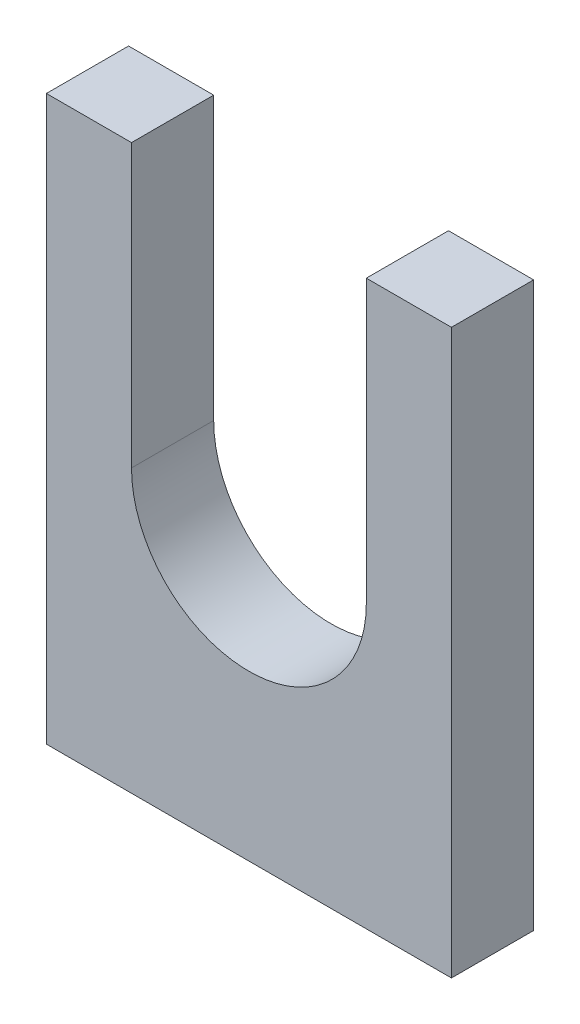
ISO-10303-21;
HEADER;
FILE_DESCRIPTION(('STEP AP214'),'2;1');
FILE_NAME('part.step','',(''),(''),'','','');
FILE_SCHEMA(('AUTOMOTIVE_DESIGN { 1 0 10303 214 1 1 1 1 }'));
ENDSEC;
DATA;
#1=APPLICATION_CONTEXT('core data for automotive mechanical design processes');
#2=APPLICATION_PROTOCOL_DEFINITION('international standard','automotive_design',2000,#1);
#3=PRODUCT_CONTEXT('',#1,'mechanical');
#4=PRODUCT('Part','Part','',(#3));
#5=PRODUCT_RELATED_PRODUCT_CATEGORY('part','',(#4));
#6=PRODUCT_DEFINITION_FORMATION('','',#4);
#7=PRODUCT_DEFINITION_CONTEXT('part definition',#1,'design');
#8=PRODUCT_DEFINITION('design','',#6,#7);
#9=PRODUCT_DEFINITION_SHAPE('','',#8);
#10=(LENGTH_UNIT() NAMED_UNIT(*) SI_UNIT(.MILLI.,.METRE.));
#11=(NAMED_UNIT(*) PLANE_ANGLE_UNIT() SI_UNIT($,.RADIAN.));
#12=(NAMED_UNIT(*) SI_UNIT($,.STERADIAN.) SOLID_ANGLE_UNIT());
#13=UNCERTAINTY_MEASURE_WITH_UNIT(LENGTH_MEASURE(1.E-05),#10,'distance_accuracy_value','');
#14=(GEOMETRIC_REPRESENTATION_CONTEXT(3) GLOBAL_UNCERTAINTY_ASSIGNED_CONTEXT((#13)) GLOBAL_UNIT_ASSIGNED_CONTEXT((#10,
#11,#12)) REPRESENTATION_CONTEXT('',''));
#15=CARTESIAN_POINT('',(0.,0.,0.));
#16=DIRECTION('',(0.,0.,1.));
#17=DIRECTION('',(1.,0.,0.));
#18=AXIS2_PLACEMENT_3D('',#15,#16,#17);
#19=CARTESIAN_POINT('',(-105.225,188.892405814831,23.1));
#20=DIRECTION('',(0.,-1.,0.));
#21=DIRECTION('',(0.,0.,-1.));
#22=AXIS2_PLACEMENT_3D('',#19,#20,#21);
#23=PLANE('',#22);
#24=DIRECTION('',(-1.,0.,0.));
#25=VECTOR('',#24,1.);
#26=CARTESIAN_POINT('',(-105.225,188.892405814831,-21.35));
#27=LINE('',#26,#25);
#28=CARTESIAN_POINT('',(-59.1875,188.892405814831,-21.35));
#29=VERTEX_POINT('',#28);
#30=CARTESIAN_POINT('',(-105.225,188.892405814831,-21.35));
#31=VERTEX_POINT('',#30);
#32=EDGE_CURVE('E131',#29,#31,#27,.T.);
#33=ORIENTED_EDGE('',*,*,#32,.T.);
#34=DIRECTION('',(0.,0.,-1.));
#35=VECTOR('',#34,1.);
#36=CARTESIAN_POINT('',(-105.225,188.892405814831,23.1));
#37=LINE('',#36,#35);
#38=CARTESIAN_POINT('',(-105.225,188.892405814831,23.1));
#39=VERTEX_POINT('',#38);
#40=EDGE_CURVE('E11',#39,#31,#37,.T.);
#41=ORIENTED_EDGE('',*,*,#40,.F.);
#42=DIRECTION('',(-1.,0.,0.));
#43=VECTOR('',#42,1.);
#44=CARTESIAN_POINT('',(-105.225,188.892405814831,23.1));
#45=LINE('',#44,#43);
#46=CARTESIAN_POINT('',(-59.1875,188.892405814831,23.1));
#47=VERTEX_POINT('',#46);
#48=EDGE_CURVE('E145',#47,#39,#45,.T.);
#49=ORIENTED_EDGE('',*,*,#48,.F.);
#50=DIRECTION('',(0.,0.,-1.));
#51=VECTOR('',#50,1.);
#52=CARTESIAN_POINT('',(-59.1875,188.892405814831,23.1));
#53=LINE('',#52,#51);
#54=EDGE_CURVE('E127',#47,#29,#53,.T.);
#55=ORIENTED_EDGE('',*,*,#54,.T.);
#56=EDGE_LOOP('',(#33,#41,#49,#55));
#57=FACE_BOUND('',#56,.T.);
#58=ADVANCED_FACE('F35',(#57),#23,.F.);
#59=CARTESIAN_POINT('',(-105.225,188.892405814831,23.1));
#60=DIRECTION('',(1.,0.,0.));
#61=DIRECTION('',(0.,1.,0.));
#62=AXIS2_PLACEMENT_3D('',#59,#60,#61);
#63=PLANE('',#62);
#64=DIRECTION('',(0.,-1.,0.));
#65=VECTOR('',#64,1.);
#66=CARTESIAN_POINT('',(-105.225,188.892405814831,-21.35));
#67=LINE('',#66,#65);
#68=CARTESIAN_POINT('',(-105.225,-115.907594185169,-21.35));
#69=VERTEX_POINT('',#68);
#70=EDGE_CURVE('E134',#31,#69,#67,.T.);
#71=ORIENTED_EDGE('',*,*,#70,.T.);
#72=DIRECTION('',(0.,0.,-1.));
#73=VECTOR('',#72,1.);
#74=CARTESIAN_POINT('',(-105.225,-115.907594185169,23.1));
#75=LINE('',#74,#73);
#76=CARTESIAN_POINT('',(-105.225,-115.907594185169,23.1));
#77=VERTEX_POINT('',#76);
#78=EDGE_CURVE('E43',#77,#69,#75,.T.);
#79=ORIENTED_EDGE('',*,*,#78,.F.);
#80=DIRECTION('',(0.,-1.,0.));
#81=VECTOR('',#80,1.);
#82=CARTESIAN_POINT('',(-105.225,188.892405814831,23.1));
#83=LINE('',#82,#81);
#84=EDGE_CURVE('E94',#39,#77,#83,.T.);
#85=ORIENTED_EDGE('',*,*,#84,.F.);
#86=ORIENTED_EDGE('',*,*,#40,.T.);
#87=EDGE_LOOP('',(#71,#79,#85,#86));
#88=FACE_BOUND('',#87,.T.);
#89=ADVANCED_FACE('F180',(#88),#63,.F.);
#90=CARTESIAN_POINT('',(-105.225,-115.907594185169,23.1));
#91=DIRECTION('',(0.,1.,0.));
#92=DIRECTION('',(0.,0.,1.));
#93=AXIS2_PLACEMENT_3D('',#90,#91,#92);
#94=PLANE('',#93);
#95=DIRECTION('',(1.,0.,0.));
#96=VECTOR('',#95,1.);
#97=CARTESIAN_POINT('',(-105.225,-115.907594185169,-21.35));
#98=LINE('',#97,#96);
#99=CARTESIAN_POINT('',(113.85,-115.907594185169,-21.35));
#100=VERTEX_POINT('',#99);
#101=EDGE_CURVE('E136',#69,#100,#98,.T.);
#102=ORIENTED_EDGE('',*,*,#101,.T.);
#103=DIRECTION('',(0.,0.,-1.));
#104=VECTOR('',#103,1.);
#105=CARTESIAN_POINT('',(113.85,-115.907594185169,23.1));
#106=LINE('',#105,#104);
#107=CARTESIAN_POINT('',(113.85,-115.907594185169,23.1));
#108=VERTEX_POINT('',#107);
#109=EDGE_CURVE('E152',#108,#100,#106,.T.);
#110=ORIENTED_EDGE('',*,*,#109,.F.);
#111=DIRECTION('',(1.,0.,0.));
#112=VECTOR('',#111,1.);
#113=CARTESIAN_POINT('',(-105.225,-115.907594185169,23.1));
#114=LINE('',#113,#112);
#115=EDGE_CURVE('E160',#77,#108,#114,.T.);
#116=ORIENTED_EDGE('',*,*,#115,.F.);
#117=ORIENTED_EDGE('',*,*,#78,.T.);
#118=EDGE_LOOP('',(#102,#110,#116,#117));
#119=FACE_BOUND('',#118,.T.);
#120=ADVANCED_FACE('F158',(#119),#94,.F.);
#121=CARTESIAN_POINT('',(113.85,-115.907594185169,23.1));
#122=DIRECTION('',(-1.,0.,0.));
#123=DIRECTION('',(0.,0.,1.));
#124=AXIS2_PLACEMENT_3D('',#121,#122,#123);
#125=PLANE('',#124);
#126=DIRECTION('',(0.,1.,0.));
#127=VECTOR('',#126,1.);
#128=CARTESIAN_POINT('',(113.85,-115.907594185169,-21.35));
#129=LINE('',#128,#127);
#130=CARTESIAN_POINT('',(113.85,188.892405814831,-21.35));
#131=VERTEX_POINT('',#130);
#132=EDGE_CURVE('E138',#100,#131,#129,.T.);
#133=ORIENTED_EDGE('',*,*,#132,.T.);
#134=DIRECTION('',(0.,0.,-1.));
#135=VECTOR('',#134,1.);
#136=CARTESIAN_POINT('',(113.85,188.892405814831,23.1));
#137=LINE('',#136,#135);
#138=CARTESIAN_POINT('',(113.85,188.892405814831,23.1));
#139=VERTEX_POINT('',#138);
#140=EDGE_CURVE('E149',#139,#131,#137,.T.);
#141=ORIENTED_EDGE('',*,*,#140,.F.);
#142=DIRECTION('',(0.,1.,0.));
#143=VECTOR('',#142,1.);
#144=CARTESIAN_POINT('',(113.85,-115.907594185169,23.1));
#145=LINE('',#144,#143);
#146=EDGE_CURVE('E172',#108,#139,#145,.T.);
#147=ORIENTED_EDGE('',*,*,#146,.F.);
#148=ORIENTED_EDGE('',*,*,#109,.T.);
#149=EDGE_LOOP('',(#133,#141,#147,#148));
#150=FACE_BOUND('',#149,.T.);
#151=ADVANCED_FACE('F168',(#150),#125,.F.);
#152=CARTESIAN_POINT('',(113.85,188.892405814831,23.1));
#153=DIRECTION('',(0.,-1.,0.));
#154=DIRECTION('',(0.,0.,-1.));
#155=AXIS2_PLACEMENT_3D('',#152,#153,#154);
#156=PLANE('',#155);
#157=DIRECTION('',(-1.,0.,0.));
#158=VECTOR('',#157,1.);
#159=CARTESIAN_POINT('',(113.85,188.892405814831,-21.35));
#160=LINE('',#159,#158);
#161=CARTESIAN_POINT('',(67.8125,188.892405814831,-21.35));
#162=VERTEX_POINT('',#161);
#163=EDGE_CURVE('E140',#131,#162,#160,.T.);
#164=ORIENTED_EDGE('',*,*,#163,.T.);
#165=DIRECTION('',(0.,0.,-1.));
#166=VECTOR('',#165,1.);
#167=CARTESIAN_POINT('',(67.8125,188.892405814831,23.1));
#168=LINE('',#167,#166);
#169=CARTESIAN_POINT('',(67.8125,188.892405814831,23.1));
#170=VERTEX_POINT('',#169);
#171=EDGE_CURVE('E122',#170,#162,#168,.T.);
#172=ORIENTED_EDGE('',*,*,#171,.F.);
#173=DIRECTION('',(-1.,0.,0.));
#174=VECTOR('',#173,1.);
#175=CARTESIAN_POINT('',(113.85,188.892405814831,23.1));
#176=LINE('',#175,#174);
#177=EDGE_CURVE('E113',#139,#170,#176,.T.);
#178=ORIENTED_EDGE('',*,*,#177,.F.);
#179=ORIENTED_EDGE('',*,*,#140,.T.);
#180=EDGE_LOOP('',(#164,#172,#178,#179));
#181=FACE_BOUND('',#180,.T.);
#182=ADVANCED_FACE('F171',(#181),#156,.F.);
#183=CARTESIAN_POINT('',(67.8125,36.4924058148307,23.1));
#184=DIRECTION('',(1.,0.,0.));
#185=DIRECTION('',(0.,0.,-1.));
#186=AXIS2_PLACEMENT_3D('',#183,#184,#185);
#187=PLANE('',#186);
#188=DIRECTION('',(0.,-1.,0.));
#189=VECTOR('',#188,1.);
#190=CARTESIAN_POINT('',(67.8125,36.4924058148307,-21.35));
#191=LINE('',#190,#189);
#192=CARTESIAN_POINT('',(67.8125,36.4924058148307,-21.35));
#193=VERTEX_POINT('',#192);
#194=EDGE_CURVE('E121',#162,#193,#191,.T.);
#195=ORIENTED_EDGE('',*,*,#194,.T.);
#196=DIRECTION('',(0.,0.,-1.));
#197=VECTOR('',#196,1.);
#198=CARTESIAN_POINT('',(67.8125,36.4924058148307,23.1));
#199=LINE('',#198,#197);
#200=CARTESIAN_POINT('',(67.8125,36.4924058148307,23.1));
#201=VERTEX_POINT('',#200);
#202=EDGE_CURVE('E118',#201,#193,#199,.T.);
#203=ORIENTED_EDGE('',*,*,#202,.F.);
#204=DIRECTION('',(0.,-1.,0.));
#205=VECTOR('',#204,1.);
#206=CARTESIAN_POINT('',(67.8125,36.4924058148307,23.1));
#207=LINE('',#206,#205);
#208=EDGE_CURVE('E107',#170,#201,#207,.T.);
#209=ORIENTED_EDGE('',*,*,#208,.F.);
#210=ORIENTED_EDGE('',*,*,#171,.T.);
#211=EDGE_LOOP('',(#195,#203,#209,#210));
#212=FACE_BOUND('',#211,.T.);
#213=ADVANCED_FACE('F119',(#212),#187,.F.);
#214=CARTESIAN_POINT('',(4.3125,36.4924058148307,23.1));
#215=DIRECTION('',(0.,0.,-1.));
#216=DIRECTION('',(-1.,0.,0.));
#217=AXIS2_PLACEMENT_3D('',#214,#215,#216);
#218=CYLINDRICAL_SURFACE('',#217,63.5);
#219=CARTESIAN_POINT('',(4.3125,36.4924058148307,-21.35));
#220=DIRECTION('',(0.,0.,-1.));
#221=DIRECTION('',(-1.,0.,0.));
#222=AXIS2_PLACEMENT_3D('',#219,#220,#221);
#223=CIRCLE('',#222,63.5);
#224=CARTESIAN_POINT('',(-59.1875,36.4924058148307,-21.35));
#225=VERTEX_POINT('',#224);
#226=EDGE_CURVE('E80',#193,#225,#223,.T.);
#227=ORIENTED_EDGE('',*,*,#226,.T.);
#228=DIRECTION('',(0.,0.,-1.));
#229=VECTOR('',#228,1.);
#230=CARTESIAN_POINT('',(-59.1875,36.4924058148307,23.1));
#231=LINE('',#230,#229);
#232=CARTESIAN_POINT('',(-59.1875,36.4924058148307,23.1));
#233=VERTEX_POINT('',#232);
#234=EDGE_CURVE('E123',#233,#225,#231,.T.);
#235=ORIENTED_EDGE('',*,*,#234,.F.);
#236=CARTESIAN_POINT('',(4.3125,36.4924058148307,23.1));
#237=DIRECTION('',(0.,0.,-1.));
#238=DIRECTION('',(-1.,0.,0.));
#239=AXIS2_PLACEMENT_3D('',#236,#237,#238);
#240=CIRCLE('',#239,63.5);
#241=EDGE_CURVE('E111',#201,#233,#240,.T.);
#242=ORIENTED_EDGE('',*,*,#241,.F.);
#243=ORIENTED_EDGE('',*,*,#202,.T.);
#244=EDGE_LOOP('',(#227,#235,#242,#243));
#245=FACE_BOUND('',#244,.T.);
#246=ADVANCED_FACE('F125',(#245),#218,.F.);
#247=CARTESIAN_POINT('',(-59.1875,188.892405814831,23.1));
#248=DIRECTION('',(-1.,0.,0.));
#249=DIRECTION('',(0.,0.,1.));
#250=AXIS2_PLACEMENT_3D('',#247,#248,#249);
#251=PLANE('',#250);
#252=DIRECTION('',(0.,1.,0.));
#253=VECTOR('',#252,1.);
#254=CARTESIAN_POINT('',(-59.1875,188.892405814831,-21.35));
#255=LINE('',#254,#253);
#256=EDGE_CURVE('E86',#225,#29,#255,.T.);
#257=ORIENTED_EDGE('',*,*,#256,.T.);
#258=ORIENTED_EDGE('',*,*,#54,.F.);
#259=DIRECTION('',(0.,1.,0.));
#260=VECTOR('',#259,1.);
#261=CARTESIAN_POINT('',(-59.1875,188.892405814831,23.1));
#262=LINE('',#261,#260);
#263=EDGE_CURVE('E51',#233,#47,#262,.T.);
#264=ORIENTED_EDGE('',*,*,#263,.F.);
#265=ORIENTED_EDGE('',*,*,#234,.T.);
#266=EDGE_LOOP('',(#257,#258,#264,#265));
#267=FACE_BOUND('',#266,.T.);
#268=ADVANCED_FACE('F196',(#267),#251,.F.);
#269=CARTESIAN_POINT('',(4.3125,36.4924058148307,23.1));
#270=DIRECTION('',(0.,0.,-1.));
#271=DIRECTION('',(-1.,0.,0.));
#272=AXIS2_PLACEMENT_3D('',#269,#270,#271);
#273=PLANE('',#272);
#274=ORIENTED_EDGE('',*,*,#48,.T.);
#275=ORIENTED_EDGE('',*,*,#84,.T.);
#276=ORIENTED_EDGE('',*,*,#115,.T.);
#277=ORIENTED_EDGE('',*,*,#146,.T.);
#278=ORIENTED_EDGE('',*,*,#177,.T.);
#279=ORIENTED_EDGE('',*,*,#208,.T.);
#280=ORIENTED_EDGE('',*,*,#241,.T.);
#281=ORIENTED_EDGE('',*,*,#263,.T.);
#282=EDGE_LOOP('',(#274,#275,#276,#277,#278,#279,#280,#281));
#283=FACE_BOUND('',#282,.T.);
#284=ADVANCED_FACE('F109',(#283),#273,.F.);
#285=CARTESIAN_POINT('',(4.3125,36.4924058148307,-21.35));
#286=DIRECTION('',(0.,0.,-1.));
#287=DIRECTION('',(-1.,0.,0.));
#288=AXIS2_PLACEMENT_3D('',#285,#286,#287);
#289=PLANE('',#288);
#290=ORIENTED_EDGE('',*,*,#32,.F.);
#291=ORIENTED_EDGE('',*,*,#256,.F.);
#292=ORIENTED_EDGE('',*,*,#226,.F.);
#293=ORIENTED_EDGE('',*,*,#194,.F.);
#294=ORIENTED_EDGE('',*,*,#163,.F.);
#295=ORIENTED_EDGE('',*,*,#132,.F.);
#296=ORIENTED_EDGE('',*,*,#101,.F.);
#297=ORIENTED_EDGE('',*,*,#70,.F.);
#298=EDGE_LOOP('',(#290,#291,#292,#293,#294,#295,#296,#297));
#299=FACE_BOUND('',#298,.T.);
#300=ADVANCED_FACE('F164',(#299),#289,.T.);
#301=CLOSED_SHELL('',(#58,#89,#120,#151,#182,#213,#246,#268,#284,#300));
#302=MANIFOLD_SOLID_BREP('B2',#301);
#303=ADVANCED_BREP_SHAPE_REPRESENTATION('',(#18,#302),#14);
#304=SHAPE_DEFINITION_REPRESENTATION(#9,#303);
ENDSEC;
END-ISO-10303-21;
